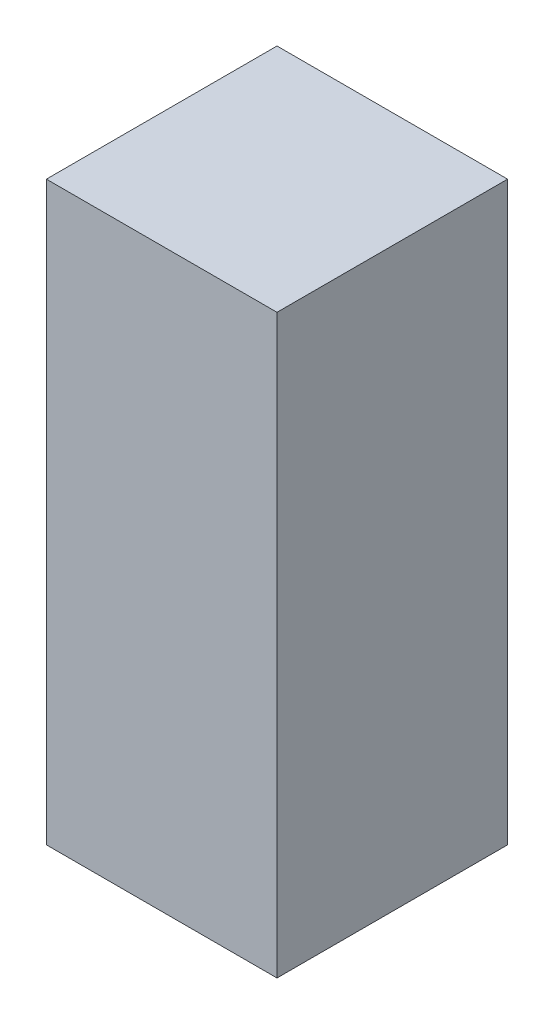
ISO-10303-21;
HEADER;
FILE_DESCRIPTION(('STEP AP214'),'2;1');
FILE_NAME('part.step','',(''),(''),'','','');
FILE_SCHEMA(('AUTOMOTIVE_DESIGN { 1 0 10303 214 1 1 1 1 }'));
ENDSEC;
DATA;
#1=APPLICATION_CONTEXT('core data for automotive mechanical design processes');
#2=APPLICATION_PROTOCOL_DEFINITION('international standard','automotive_design',2000,#1);
#3=PRODUCT_CONTEXT('',#1,'mechanical');
#4=PRODUCT('Part','Part','',(#3));
#5=PRODUCT_RELATED_PRODUCT_CATEGORY('part','',(#4));
#6=PRODUCT_DEFINITION_FORMATION('','',#4);
#7=PRODUCT_DEFINITION_CONTEXT('part definition',#1,'design');
#8=PRODUCT_DEFINITION('design','',#6,#7);
#9=PRODUCT_DEFINITION_SHAPE('','',#8);
#10=(LENGTH_UNIT() NAMED_UNIT(*) SI_UNIT(.MILLI.,.METRE.));
#11=(NAMED_UNIT(*) PLANE_ANGLE_UNIT() SI_UNIT($,.RADIAN.));
#12=(NAMED_UNIT(*) SI_UNIT($,.STERADIAN.) SOLID_ANGLE_UNIT());
#13=UNCERTAINTY_MEASURE_WITH_UNIT(LENGTH_MEASURE(1.E-05),#10,'distance_accuracy_value','');
#14=(GEOMETRIC_REPRESENTATION_CONTEXT(3) GLOBAL_UNCERTAINTY_ASSIGNED_CONTEXT((#13)) GLOBAL_UNIT_ASSIGNED_CONTEXT((#10,
#11,#12)) REPRESENTATION_CONTEXT('',''));
#15=CARTESIAN_POINT('',(0.,0.,0.));
#16=DIRECTION('',(0.,0.,1.));
#17=DIRECTION('',(1.,0.,0.));
#18=AXIS2_PLACEMENT_3D('',#15,#16,#17);
#19=CARTESIAN_POINT('',(-3.01605909851967,3.27742520718769,-3.81));
#20=DIRECTION('',(-1.,0.,0.));
#21=DIRECTION('',(0.,0.,1.));
#22=AXIS2_PLACEMENT_3D('',#19,#20,#21);
#23=PLANE('',#22);
#24=DIRECTION('',(0.,1.,0.));
#25=VECTOR('',#24,1.);
#26=CARTESIAN_POINT('',(-3.01605909851967,3.27742520718769,3.048));
#27=LINE('',#26,#25);
#28=CARTESIAN_POINT('',(-3.01605909851967,3.27742520718769,3.048));
#29=VERTEX_POINT('',#28);
#30=CARTESIAN_POINT('',(-3.01605909851967,15.7725747928123,3.048));
#31=VERTEX_POINT('',#30);
#32=EDGE_CURVE('E115',#29,#31,#27,.T.);
#33=ORIENTED_EDGE('',*,*,#32,.F.);
#34=DIRECTION('',(0.,0.,1.));
#35=VECTOR('',#34,1.);
#36=CARTESIAN_POINT('',(-3.01605909851967,3.27742520718769,-3.81));
#37=LINE('',#36,#35);
#38=CARTESIAN_POINT('',(-3.01605909851967,3.27742520718769,-3.81));
#39=VERTEX_POINT('',#38);
#40=EDGE_CURVE('E102',#39,#29,#37,.T.);
#41=ORIENTED_EDGE('',*,*,#40,.F.);
#42=DIRECTION('',(0.,-1.,0.));
#43=VECTOR('',#42,1.);
#44=CARTESIAN_POINT('',(-3.01605909851967,3.27742520718769,-3.81));
#45=LINE('',#44,#43);
#46=CARTESIAN_POINT('',(-3.01605909851967,15.7725747928123,-3.81));
#47=VERTEX_POINT('',#46);
#48=EDGE_CURVE('E118',#47,#39,#45,.T.);
#49=ORIENTED_EDGE('',*,*,#48,.F.);
#50=DIRECTION('',(0.,0.,1.));
#51=VECTOR('',#50,1.);
#52=CARTESIAN_POINT('',(-3.01605909851967,15.7725747928123,-3.81));
#53=LINE('',#52,#51);
#54=EDGE_CURVE('E116',#47,#31,#53,.T.);
#55=ORIENTED_EDGE('',*,*,#54,.T.);
#56=EDGE_LOOP('',(#33,#41,#49,#55));
#57=FACE_BOUND('',#56,.T.);
#58=ADVANCED_FACE('F37',(#57),#23,.F.);
#59=CARTESIAN_POINT('',(3.01605909851967,15.7725747928123,-3.81));
#60=DIRECTION('',(0.,1.,0.));
#61=DIRECTION('',(0.,0.,1.));
#62=AXIS2_PLACEMENT_3D('',#59,#60,#61);
#63=PLANE('',#62);
#64=DIRECTION('',(1.,0.,0.));
#65=VECTOR('',#64,1.);
#66=CARTESIAN_POINT('',(3.01605909851967,15.7725747928123,3.048));
#67=LINE('',#66,#65);
#68=CARTESIAN_POINT('',(3.01605909851967,15.7725747928123,3.048));
#69=VERTEX_POINT('',#68);
#70=EDGE_CURVE('E52',#31,#69,#67,.T.);
#71=ORIENTED_EDGE('',*,*,#70,.F.);
#72=ORIENTED_EDGE('',*,*,#54,.F.);
#73=DIRECTION('',(-1.,0.,0.));
#74=VECTOR('',#73,1.);
#75=CARTESIAN_POINT('',(3.01605909851967,15.7725747928123,-3.81));
#76=LINE('',#75,#74);
#77=CARTESIAN_POINT('',(3.01605909851967,15.7725747928123,-3.81));
#78=VERTEX_POINT('',#77);
#79=EDGE_CURVE('E112',#78,#47,#76,.T.);
#80=ORIENTED_EDGE('',*,*,#79,.F.);
#81=DIRECTION('',(0.,0.,1.));
#82=VECTOR('',#81,1.);
#83=CARTESIAN_POINT('',(3.01605909851967,15.7725747928123,-3.81));
#84=LINE('',#83,#82);
#85=EDGE_CURVE('E133',#78,#69,#84,.T.);
#86=ORIENTED_EDGE('',*,*,#85,.T.);
#87=EDGE_LOOP('',(#71,#72,#80,#86));
#88=FACE_BOUND('',#87,.T.);
#89=ADVANCED_FACE('F193',(#88),#63,.F.);
#90=CARTESIAN_POINT('',(3.01605909851967,3.27742520718769,-3.81));
#91=DIRECTION('',(1.,0.,0.));
#92=DIRECTION('',(0.,0.,-1.));
#93=AXIS2_PLACEMENT_3D('',#90,#91,#92);
#94=PLANE('',#93);
#95=DIRECTION('',(0.,-1.,0.));
#96=VECTOR('',#95,1.);
#97=CARTESIAN_POINT('',(3.01605909851967,3.27742520718769,3.048));
#98=LINE('',#97,#96);
#99=CARTESIAN_POINT('',(3.01605909851967,3.27742520718769,3.048));
#100=VERTEX_POINT('',#99);
#101=EDGE_CURVE('E60',#69,#100,#98,.T.);
#102=ORIENTED_EDGE('',*,*,#101,.F.);
#103=ORIENTED_EDGE('',*,*,#85,.F.);
#104=DIRECTION('',(0.,1.,0.));
#105=VECTOR('',#104,1.);
#106=CARTESIAN_POINT('',(3.01605909851967,3.27742520718769,-3.81));
#107=LINE('',#106,#105);
#108=CARTESIAN_POINT('',(3.01605909851967,3.27742520718768,-3.81));
#109=VERTEX_POINT('',#108);
#110=EDGE_CURVE('E126',#109,#78,#107,.T.);
#111=ORIENTED_EDGE('',*,*,#110,.F.);
#112=DIRECTION('',(0.,0.,1.));
#113=VECTOR('',#112,1.);
#114=CARTESIAN_POINT('',(3.01605909851967,3.27742520718769,-3.81));
#115=LINE('',#114,#113);
#116=EDGE_CURVE('E111',#109,#100,#115,.T.);
#117=ORIENTED_EDGE('',*,*,#116,.T.);
#118=EDGE_LOOP('',(#102,#103,#111,#117));
#119=FACE_BOUND('',#118,.T.);
#120=ADVANCED_FACE('F197',(#119),#94,.F.);
#121=CARTESIAN_POINT('',(3.01605909851967,3.27742520718769,-3.81));
#122=DIRECTION('',(0.,-1.,0.));
#123=DIRECTION('',(0.,0.,-1.));
#124=AXIS2_PLACEMENT_3D('',#121,#122,#123);
#125=PLANE('',#124);
#126=DIRECTION('',(-1.,0.,0.));
#127=VECTOR('',#126,1.);
#128=CARTESIAN_POINT('',(3.01605909851967,3.27742520718769,3.048));
#129=LINE('',#128,#127);
#130=EDGE_CURVE('E11',#100,#29,#129,.T.);
#131=ORIENTED_EDGE('',*,*,#130,.F.);
#132=ORIENTED_EDGE('',*,*,#116,.F.);
#133=DIRECTION('',(1.,0.,0.));
#134=VECTOR('',#133,1.);
#135=CARTESIAN_POINT('',(3.01605909851967,3.27742520718769,-3.81));
#136=LINE('',#135,#134);
#137=EDGE_CURVE('E107',#39,#109,#136,.T.);
#138=ORIENTED_EDGE('',*,*,#137,.F.);
#139=ORIENTED_EDGE('',*,*,#40,.T.);
#140=EDGE_LOOP('',(#131,#132,#138,#139));
#141=FACE_BOUND('',#140,.T.);
#142=ADVANCED_FACE('F104',(#141),#125,.F.);
#143=CARTESIAN_POINT('',(3.81,19.05,3.81));
#144=DIRECTION('',(-1.,0.,0.));
#145=DIRECTION('',(0.,0.,1.));
#146=AXIS2_PLACEMENT_3D('',#143,#144,#145);
#147=PLANE('',#146);
#148=DIRECTION('',(0.,0.,-1.));
#149=VECTOR('',#148,1.);
#150=CARTESIAN_POINT('',(3.81,0.,3.81));
#151=LINE('',#150,#149);
#152=CARTESIAN_POINT('',(3.81,0.,3.81));
#153=VERTEX_POINT('',#152);
#154=CARTESIAN_POINT('',(3.81,0.,-3.81));
#155=VERTEX_POINT('',#154);
#156=EDGE_CURVE('E132',#153,#155,#151,.T.);
#157=ORIENTED_EDGE('',*,*,#156,.T.);
#158=DIRECTION('',(0.,-1.,0.));
#159=VECTOR('',#158,1.);
#160=CARTESIAN_POINT('',(3.81,19.05,-3.81));
#161=LINE('',#160,#159);
#162=CARTESIAN_POINT('',(3.81,19.05,-3.81));
#163=VERTEX_POINT('',#162);
#164=EDGE_CURVE('E45',#163,#155,#161,.T.);
#165=ORIENTED_EDGE('',*,*,#164,.F.);
#166=DIRECTION('',(0.,0.,-1.));
#167=VECTOR('',#166,1.);
#168=CARTESIAN_POINT('',(3.81,19.05,3.81));
#169=LINE('',#168,#167);
#170=CARTESIAN_POINT('',(3.81,19.05,3.81));
#171=VERTEX_POINT('',#170);
#172=EDGE_CURVE('E136',#171,#163,#169,.T.);
#173=ORIENTED_EDGE('',*,*,#172,.F.);
#174=DIRECTION('',(0.,-1.,0.));
#175=VECTOR('',#174,1.);
#176=CARTESIAN_POINT('',(3.81,19.05,3.81));
#177=LINE('',#176,#175);
#178=EDGE_CURVE('E145',#171,#153,#177,.T.);
#179=ORIENTED_EDGE('',*,*,#178,.T.);
#180=EDGE_LOOP('',(#157,#165,#173,#179));
#181=FACE_BOUND('',#180,.T.);
#182=ADVANCED_FACE('F39',(#181),#147,.F.);
#183=CARTESIAN_POINT('',(-3.81,19.05,-3.81));
#184=DIRECTION('',(0.,0.,1.));
#185=DIRECTION('',(1.,0.,0.));
#186=AXIS2_PLACEMENT_3D('',#183,#184,#185);
#187=PLANE('',#186);
#188=ORIENTED_EDGE('',*,*,#79,.T.);
#189=ORIENTED_EDGE('',*,*,#48,.T.);
#190=ORIENTED_EDGE('',*,*,#137,.T.);
#191=ORIENTED_EDGE('',*,*,#110,.T.);
#192=EDGE_LOOP('',(#188,#189,#190,#191));
#193=FACE_BOUND('',#192,.T.);
#194=DIRECTION('',(-1.,0.,0.));
#195=VECTOR('',#194,1.);
#196=CARTESIAN_POINT('',(-3.81,0.,-3.81));
#197=LINE('',#196,#195);
#198=CARTESIAN_POINT('',(-3.81,0.,-3.81));
#199=VERTEX_POINT('',#198);
#200=EDGE_CURVE('E147',#155,#199,#197,.T.);
#201=ORIENTED_EDGE('',*,*,#200,.T.);
#202=DIRECTION('',(0.,-1.,0.));
#203=VECTOR('',#202,1.);
#204=CARTESIAN_POINT('',(-3.81,19.05,-3.81));
#205=LINE('',#204,#203);
#206=CARTESIAN_POINT('',(-3.81,19.05,-3.81));
#207=VERTEX_POINT('',#206);
#208=EDGE_CURVE('E157',#207,#199,#205,.T.);
#209=ORIENTED_EDGE('',*,*,#208,.F.);
#210=DIRECTION('',(-1.,0.,0.));
#211=VECTOR('',#210,1.);
#212=CARTESIAN_POINT('',(-3.81,19.05,-3.81));
#213=LINE('',#212,#211);
#214=EDGE_CURVE('E138',#163,#207,#213,.T.);
#215=ORIENTED_EDGE('',*,*,#214,.F.);
#216=ORIENTED_EDGE('',*,*,#164,.T.);
#217=EDGE_LOOP('',(#201,#209,#215,#216));
#218=FACE_BOUND('',#217,.T.);
#219=ADVANCED_FACE('F163',(#193,#218),#187,.F.);
#220=CARTESIAN_POINT('',(-3.81,19.05,3.81));
#221=DIRECTION('',(1.,0.,0.));
#222=DIRECTION('',(0.,0.,-1.));
#223=AXIS2_PLACEMENT_3D('',#220,#221,#222);
#224=PLANE('',#223);
#225=DIRECTION('',(0.,-1.,0.));
#226=VECTOR('',#225,1.);
#227=CARTESIAN_POINT('',(-3.81,19.05,3.81));
#228=LINE('',#227,#226);
#229=CARTESIAN_POINT('',(-3.81,19.05,3.81));
#230=VERTEX_POINT('',#229);
#231=CARTESIAN_POINT('',(-3.81,0.,3.81));
#232=VERTEX_POINT('',#231);
#233=EDGE_CURVE('E154',#230,#232,#228,.T.);
#234=ORIENTED_EDGE('',*,*,#233,.F.);
#235=DIRECTION('',(0.,0.,1.));
#236=VECTOR('',#235,1.);
#237=CARTESIAN_POINT('',(-3.81,19.05,3.81));
#238=LINE('',#237,#236);
#239=EDGE_CURVE('E141',#207,#230,#238,.T.);
#240=ORIENTED_EDGE('',*,*,#239,.F.);
#241=ORIENTED_EDGE('',*,*,#208,.T.);
#242=DIRECTION('',(0.,0.,1.));
#243=VECTOR('',#242,1.);
#244=CARTESIAN_POINT('',(-3.81,0.,3.81));
#245=LINE('',#244,#243);
#246=EDGE_CURVE('E149',#199,#232,#245,.T.);
#247=ORIENTED_EDGE('',*,*,#246,.T.);
#248=EDGE_LOOP('',(#234,#240,#241,#247));
#249=FACE_BOUND('',#248,.T.);
#250=ADVANCED_FACE('F176',(#249),#224,.F.);
#251=CARTESIAN_POINT('',(-3.81,19.05,3.81));
#252=DIRECTION('',(0.,0.,-1.));
#253=DIRECTION('',(-1.,0.,0.));
#254=AXIS2_PLACEMENT_3D('',#251,#252,#253);
#255=PLANE('',#254);
#256=DIRECTION('',(1.,0.,0.));
#257=VECTOR('',#256,1.);
#258=CARTESIAN_POINT('',(-3.81,0.,3.81));
#259=LINE('',#258,#257);
#260=EDGE_CURVE('E139',#232,#153,#259,.T.);
#261=ORIENTED_EDGE('',*,*,#260,.T.);
#262=ORIENTED_EDGE('',*,*,#178,.F.);
#263=DIRECTION('',(1.,0.,0.));
#264=VECTOR('',#263,1.);
#265=CARTESIAN_POINT('',(-3.81,19.05,3.81));
#266=LINE('',#265,#264);
#267=EDGE_CURVE('E143',#230,#171,#266,.T.);
#268=ORIENTED_EDGE('',*,*,#267,.F.);
#269=ORIENTED_EDGE('',*,*,#233,.T.);
#270=EDGE_LOOP('',(#261,#262,#268,#269));
#271=FACE_BOUND('',#270,.T.);
#272=ADVANCED_FACE('F180',(#271),#255,.F.);
#273=CARTESIAN_POINT('',(0.,19.05,0.));
#274=DIRECTION('',(0.,-1.,0.));
#275=DIRECTION('',(0.,0.,-1.));
#276=AXIS2_PLACEMENT_3D('',#273,#274,#275);
#277=PLANE('',#276);
#278=ORIENTED_EDGE('',*,*,#172,.T.);
#279=ORIENTED_EDGE('',*,*,#214,.T.);
#280=ORIENTED_EDGE('',*,*,#239,.T.);
#281=ORIENTED_EDGE('',*,*,#267,.T.);
#282=EDGE_LOOP('',(#278,#279,#280,#281));
#283=FACE_BOUND('',#282,.T.);
#284=ADVANCED_FACE('F182',(#283),#277,.F.);
#285=CARTESIAN_POINT('',(0.,0.,0.));
#286=DIRECTION('',(0.,-1.,0.));
#287=DIRECTION('',(0.,0.,-1.));
#288=AXIS2_PLACEMENT_3D('',#285,#286,#287);
#289=PLANE('',#288);
#290=ORIENTED_EDGE('',*,*,#260,.F.);
#291=ORIENTED_EDGE('',*,*,#246,.F.);
#292=ORIENTED_EDGE('',*,*,#200,.F.);
#293=ORIENTED_EDGE('',*,*,#156,.F.);
#294=EDGE_LOOP('',(#290,#291,#292,#293));
#295=FACE_BOUND('',#294,.T.);
#296=ADVANCED_FACE('F173',(#295),#289,.T.);
#297=CARTESIAN_POINT('',(0.,0.,3.048));
#298=DIRECTION('',(0.,0.,1.));
#299=DIRECTION('',(1.,0.,0.));
#300=AXIS2_PLACEMENT_3D('',#297,#298,#299);
#301=PLANE('',#300);
#302=ORIENTED_EDGE('',*,*,#130,.T.);
#303=ORIENTED_EDGE('',*,*,#32,.T.);
#304=ORIENTED_EDGE('',*,*,#70,.T.);
#305=ORIENTED_EDGE('',*,*,#101,.T.);
#306=EDGE_LOOP('',(#302,#303,#304,#305));
#307=FACE_BOUND('',#306,.T.);
#308=ADVANCED_FACE('F120',(#307),#301,.F.);
#309=CLOSED_SHELL('',(#58,#89,#120,#142,#182,#219,#250,#272,#284,#296,#308));
#310=MANIFOLD_SOLID_BREP('B2',#309);
#311=ADVANCED_BREP_SHAPE_REPRESENTATION('',(#18,#310),#14);
#312=SHAPE_DEFINITION_REPRESENTATION(#9,#311);
ENDSEC;
END-ISO-10303-21;
